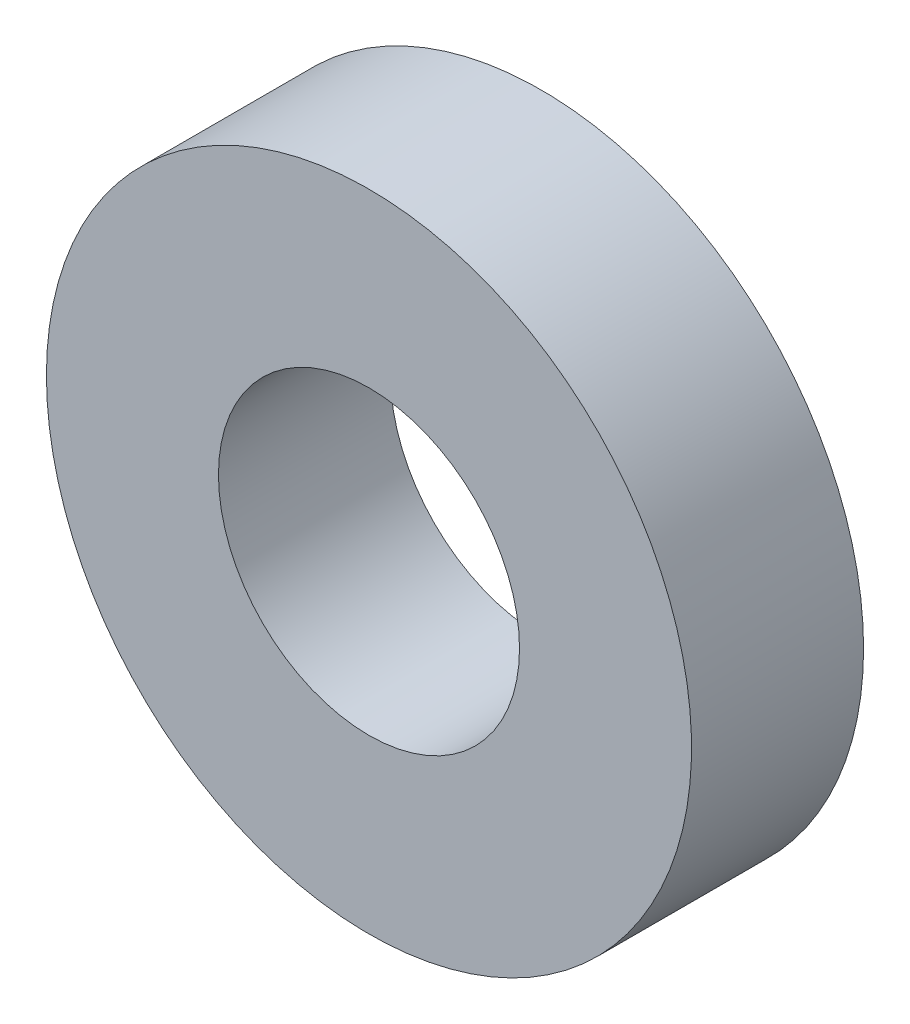
ISO-10303-21;
HEADER;
FILE_DESCRIPTION(('STEP AP214'),'2;1');
FILE_NAME('part.step','',(''),(''),'','','');
FILE_SCHEMA(('AUTOMOTIVE_DESIGN { 1 0 10303 214 1 1 1 1 }'));
ENDSEC;
DATA;
#1=APPLICATION_CONTEXT('core data for automotive mechanical design processes');
#2=APPLICATION_PROTOCOL_DEFINITION('international standard','automotive_design',2000,#1);
#3=PRODUCT_CONTEXT('',#1,'mechanical');
#4=PRODUCT('Part','Part','',(#3));
#5=PRODUCT_RELATED_PRODUCT_CATEGORY('part','',(#4));
#6=PRODUCT_DEFINITION_FORMATION('','',#4);
#7=PRODUCT_DEFINITION_CONTEXT('part definition',#1,'design');
#8=PRODUCT_DEFINITION('design','',#6,#7);
#9=PRODUCT_DEFINITION_SHAPE('','',#8);
#10=(LENGTH_UNIT() NAMED_UNIT(*) SI_UNIT(.MILLI.,.METRE.));
#11=(NAMED_UNIT(*) PLANE_ANGLE_UNIT() SI_UNIT($,.RADIAN.));
#12=(NAMED_UNIT(*) SI_UNIT($,.STERADIAN.) SOLID_ANGLE_UNIT());
#13=UNCERTAINTY_MEASURE_WITH_UNIT(LENGTH_MEASURE(1.E-05),#10,'distance_accuracy_value','');
#14=(GEOMETRIC_REPRESENTATION_CONTEXT(3) GLOBAL_UNCERTAINTY_ASSIGNED_CONTEXT((#13)) GLOBAL_UNIT_ASSIGNED_CONTEXT((#10,
#11,#12)) REPRESENTATION_CONTEXT('',''));
#15=CARTESIAN_POINT('',(0.,0.,0.));
#16=DIRECTION('',(0.,0.,1.));
#17=DIRECTION('',(1.,0.,0.));
#18=AXIS2_PLACEMENT_3D('',#15,#16,#17);
#19=CARTESIAN_POINT('',(-1.66533453693773E-13,5.79999999999999,0.));
#20=DIRECTION('',(0.,0.,0.999999999999998));
#21=DIRECTION('',(1.,0.,0.));
#22=AXIS2_PLACEMENT_3D('',#19,#20,#21);
#23=PLANE('',#22);
#24=CARTESIAN_POINT('',(-1.66533453693773E-13,5.79999999999999,0.));
#25=DIRECTION('',(0.,0.,0.999999999999998));
#26=DIRECTION('',(1.,0.,0.));
#27=AXIS2_PLACEMENT_3D('',#24,#25,#26);
#28=CIRCLE('',#27,11.25);
#29=CARTESIAN_POINT('',(11.2499999999999,5.79999999999999,0.));
#30=VERTEX_POINT('',#29);
#31=EDGE_CURVE('E49',#30,#30,#28,.T.);
#32=ORIENTED_EDGE('',*,*,#31,.F.);
#33=EDGE_LOOP('',(#32));
#34=FACE_BOUND('',#33,.T.);
#35=CARTESIAN_POINT('',(-1.66533453693773E-13,5.79999999999999,0.));
#36=DIRECTION('',(0.,0.,0.999999999999998));
#37=DIRECTION('',(1.,0.,0.));
#38=AXIS2_PLACEMENT_3D('',#35,#36,#37);
#39=CIRCLE('',#38,5.25);
#40=CARTESIAN_POINT('',(5.24999999999985,5.79999999999999,0.));
#41=VERTEX_POINT('',#40);
#42=EDGE_CURVE('E58',#41,#41,#39,.T.);
#43=ORIENTED_EDGE('',*,*,#42,.T.);
#44=EDGE_LOOP('',(#43));
#45=FACE_BOUND('',#44,.T.);
#46=ADVANCED_FACE('F42',(#34,#45),#23,.F.);
#47=CARTESIAN_POINT('',(-1.66533453693773E-13,5.79999999999999,37.8198051533945));
#48=DIRECTION('',(0.,0.,-0.999999999999998));
#49=DIRECTION('',(-1.,0.,0.));
#50=AXIS2_PLACEMENT_3D('',#47,#48,#49);
#51=CYLINDRICAL_SURFACE('',#50,11.25);
#52=CARTESIAN_POINT('',(-1.66533453693773E-13,5.79999999999999,5.99999999999992));
#53=DIRECTION('',(0.,0.,-0.999999999999998));
#54=DIRECTION('',(-1.,0.,0.));
#55=AXIS2_PLACEMENT_3D('',#52,#53,#54);
#56=CIRCLE('',#55,11.25);
#57=CARTESIAN_POINT('',(-11.2500000000002,5.79999999999998,5.99999999999992));
#58=VERTEX_POINT('',#57);
#59=EDGE_CURVE('E53',#58,#58,#56,.T.);
#60=ORIENTED_EDGE('',*,*,#59,.T.);
#61=EDGE_LOOP('',(#60));
#62=FACE_BOUND('',#61,.T.);
#63=ORIENTED_EDGE('',*,*,#31,.T.);
#64=EDGE_LOOP('',(#63));
#65=FACE_BOUND('',#64,.T.);
#66=ADVANCED_FACE('F66',(#62,#65),#51,.T.);
#67=CARTESIAN_POINT('',(-1.66533453693773E-13,5.79999999999999,37.8198051533945));
#68=DIRECTION('',(0.,0.,-0.999999999999998));
#69=DIRECTION('',(-1.,0.,0.));
#70=AXIS2_PLACEMENT_3D('',#67,#68,#69);
#71=CYLINDRICAL_SURFACE('',#70,5.25);
#72=CARTESIAN_POINT('',(-1.66533453693773E-13,5.79999999999999,5.99999999999992));
#73=DIRECTION('',(0.,0.,-0.999999999999998));
#74=DIRECTION('',(-1.,0.,0.));
#75=AXIS2_PLACEMENT_3D('',#72,#73,#74);
#76=CIRCLE('',#75,5.25);
#77=CARTESIAN_POINT('',(-5.25000000000018,5.79999999999999,5.99999999999992));
#78=VERTEX_POINT('',#77);
#79=EDGE_CURVE('E12',#78,#78,#76,.T.);
#80=ORIENTED_EDGE('',*,*,#79,.F.);
#81=EDGE_LOOP('',(#80));
#82=FACE_BOUND('',#81,.T.);
#83=ORIENTED_EDGE('',*,*,#42,.F.);
#84=EDGE_LOOP('',(#83));
#85=FACE_BOUND('',#84,.T.);
#86=ADVANCED_FACE('F64',(#82,#85),#71,.F.);
#87=CARTESIAN_POINT('',(42.5000852449602,-8.98995074304522,5.99999999999992));
#88=DIRECTION('',(0.,0.,-0.999999999999998));
#89=DIRECTION('',(-1.,0.,0.));
#90=AXIS2_PLACEMENT_3D('',#87,#88,#89);
#91=PLANE('',#90);
#92=ORIENTED_EDGE('',*,*,#79,.T.);
#93=EDGE_LOOP('',(#92));
#94=FACE_BOUND('',#93,.T.);
#95=ORIENTED_EDGE('',*,*,#59,.F.);
#96=EDGE_LOOP('',(#95));
#97=FACE_BOUND('',#96,.T.);
#98=ADVANCED_FACE('F44',(#94,#97),#91,.F.);
#99=CLOSED_SHELL('',(#46,#66,#86,#98));
#100=MANIFOLD_SOLID_BREP('B2',#99);
#101=ADVANCED_BREP_SHAPE_REPRESENTATION('',(#18,#100),#14);
#102=SHAPE_DEFINITION_REPRESENTATION(#9,#101);
ENDSEC;
END-ISO-10303-21;
